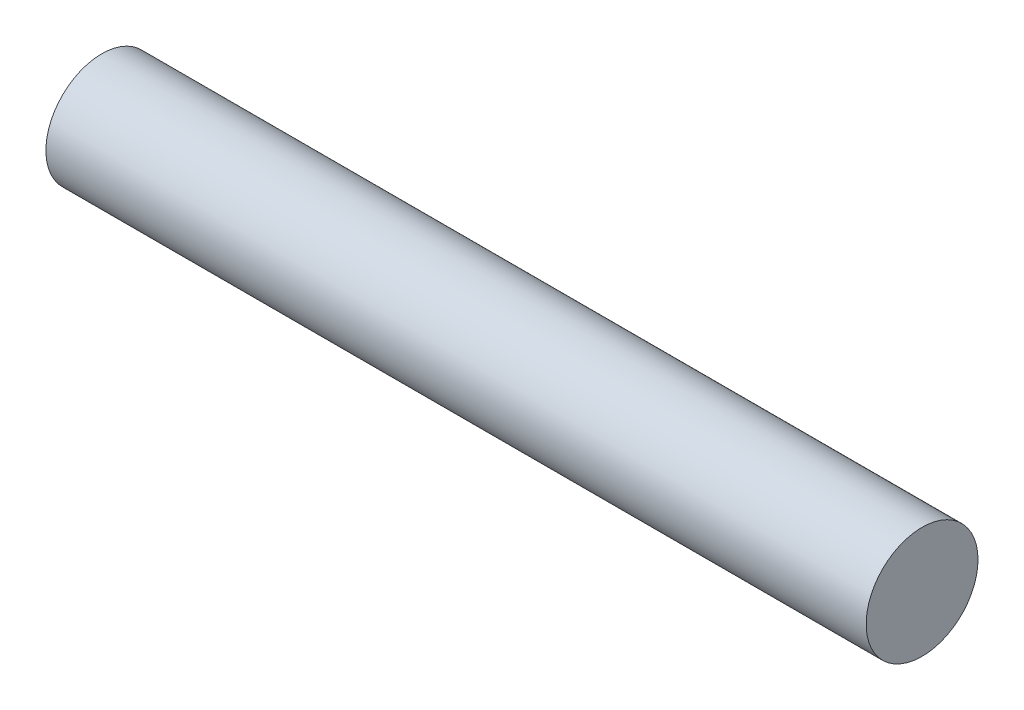
ISO-10303-21;
HEADER;
FILE_DESCRIPTION(('STEP AP214'),'2;1');
FILE_NAME('part.step','',(''),(''),'','','');
FILE_SCHEMA(('AUTOMOTIVE_DESIGN { 1 0 10303 214 1 1 1 1 }'));
ENDSEC;
DATA;
#1=APPLICATION_CONTEXT('core data for automotive mechanical design processes');
#2=APPLICATION_PROTOCOL_DEFINITION('international standard','automotive_design',2000,#1);
#3=PRODUCT_CONTEXT('',#1,'mechanical');
#4=PRODUCT('Part','Part','',(#3));
#5=PRODUCT_RELATED_PRODUCT_CATEGORY('part','',(#4));
#6=PRODUCT_DEFINITION_FORMATION('','',#4);
#7=PRODUCT_DEFINITION_CONTEXT('part definition',#1,'design');
#8=PRODUCT_DEFINITION('design','',#6,#7);
#9=PRODUCT_DEFINITION_SHAPE('','',#8);
#10=(LENGTH_UNIT() NAMED_UNIT(*) SI_UNIT(.MILLI.,.METRE.));
#11=(NAMED_UNIT(*) PLANE_ANGLE_UNIT() SI_UNIT($,.RADIAN.));
#12=(NAMED_UNIT(*) SI_UNIT($,.STERADIAN.) SOLID_ANGLE_UNIT());
#13=UNCERTAINTY_MEASURE_WITH_UNIT(LENGTH_MEASURE(1.E-05),#10,'distance_accuracy_value','');
#14=(GEOMETRIC_REPRESENTATION_CONTEXT(3) GLOBAL_UNCERTAINTY_ASSIGNED_CONTEXT((#13)) GLOBAL_UNIT_ASSIGNED_CONTEXT((#10,
#11,#12)) REPRESENTATION_CONTEXT('',''));
#15=CARTESIAN_POINT('',(0.,0.,0.));
#16=DIRECTION('',(0.,0.,1.));
#17=DIRECTION('',(1.,0.,0.));
#18=AXIS2_PLACEMENT_3D('',#15,#16,#17);
#19=CARTESIAN_POINT('',(22.,0.,0.));
#20=DIRECTION('',(-1.,0.,0.));
#21=DIRECTION('',(0.,0.,1.));
#22=AXIS2_PLACEMENT_3D('',#19,#20,#21);
#23=CYLINDRICAL_SURFACE('',#22,1.5);
#24=CARTESIAN_POINT('',(22.,0.,0.));
#25=DIRECTION('',(1.,0.,0.));
#26=DIRECTION('',(0.,0.,-1.));
#27=AXIS2_PLACEMENT_3D('',#24,#25,#26);
#28=CIRCLE('',#27,1.5);
#29=CARTESIAN_POINT('',(22.,0.,-1.5));
#30=VERTEX_POINT('',#29);
#31=EDGE_CURVE('E10',#30,#30,#28,.T.);
#32=ORIENTED_EDGE('',*,*,#31,.F.);
#33=EDGE_LOOP('',(#32));
#34=FACE_BOUND('',#33,.T.);
#35=CARTESIAN_POINT('',(0.,0.,0.));
#36=DIRECTION('',(1.,0.,0.));
#37=DIRECTION('',(0.,0.,-1.));
#38=AXIS2_PLACEMENT_3D('',#35,#36,#37);
#39=CIRCLE('',#38,1.5);
#40=CARTESIAN_POINT('',(0.,0.,-1.5));
#41=VERTEX_POINT('',#40);
#42=EDGE_CURVE('E36',#41,#41,#39,.T.);
#43=ORIENTED_EDGE('',*,*,#42,.T.);
#44=EDGE_LOOP('',(#43));
#45=FACE_BOUND('',#44,.T.);
#46=ADVANCED_FACE('F33',(#34,#45),#23,.T.);
#47=CARTESIAN_POINT('',(22.,0.,0.));
#48=DIRECTION('',(1.,0.,0.));
#49=DIRECTION('',(0.,0.,-1.));
#50=AXIS2_PLACEMENT_3D('',#47,#48,#49);
#51=PLANE('',#50);
#52=ORIENTED_EDGE('',*,*,#31,.T.);
#53=EDGE_LOOP('',(#52));
#54=FACE_BOUND('',#53,.T.);
#55=ADVANCED_FACE('F50',(#54),#51,.T.);
#56=CARTESIAN_POINT('',(0.,0.,0.));
#57=DIRECTION('',(1.,0.,0.));
#58=DIRECTION('',(0.,0.,-1.));
#59=AXIS2_PLACEMENT_3D('',#56,#57,#58);
#60=PLANE('',#59);
#61=ORIENTED_EDGE('',*,*,#42,.F.);
#62=EDGE_LOOP('',(#61));
#63=FACE_BOUND('',#62,.T.);
#64=ADVANCED_FACE('F48',(#63),#60,.F.);
#65=CLOSED_SHELL('',(#46,#55,#64));
#66=MANIFOLD_SOLID_BREP('B2',#65);
#67=ADVANCED_BREP_SHAPE_REPRESENTATION('',(#18,#66),#14);
#68=SHAPE_DEFINITION_REPRESENTATION(#9,#67);
ENDSEC;
END-ISO-10303-21;
